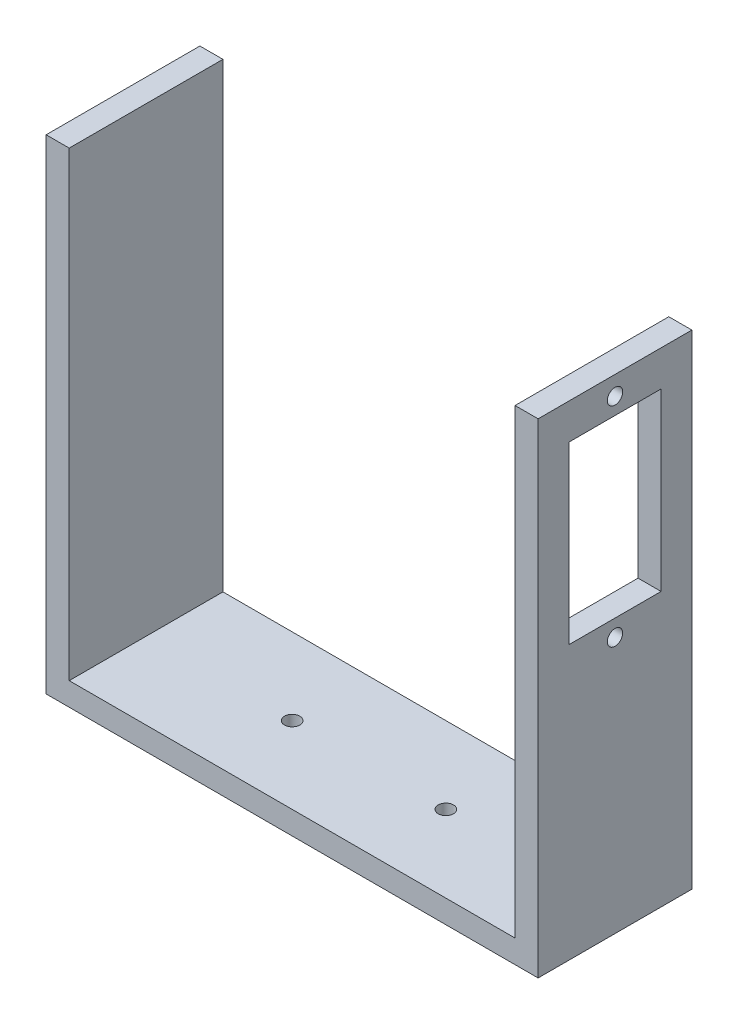
ISO-10303-21;
HEADER;
FILE_DESCRIPTION(('STEP AP214'),'2;1');
FILE_NAME('part.step','',(''),(''),'','','');
FILE_SCHEMA(('AUTOMOTIVE_DESIGN { 1 0 10303 214 1 1 1 1 }'));
ENDSEC;
DATA;
#1=APPLICATION_CONTEXT('core data for automotive mechanical design processes');
#2=APPLICATION_PROTOCOL_DEFINITION('international standard','automotive_design',2000,#1);
#3=PRODUCT_CONTEXT('',#1,'mechanical');
#4=PRODUCT('Part','Part','',(#3));
#5=PRODUCT_RELATED_PRODUCT_CATEGORY('part','',(#4));
#6=PRODUCT_DEFINITION_FORMATION('','',#4);
#7=PRODUCT_DEFINITION_CONTEXT('part definition',#1,'design');
#8=PRODUCT_DEFINITION('design','',#6,#7);
#9=PRODUCT_DEFINITION_SHAPE('','',#8);
#10=(LENGTH_UNIT() NAMED_UNIT(*) SI_UNIT(.MILLI.,.METRE.));
#11=(NAMED_UNIT(*) PLANE_ANGLE_UNIT() SI_UNIT($,.RADIAN.));
#12=(NAMED_UNIT(*) SI_UNIT($,.STERADIAN.) SOLID_ANGLE_UNIT());
#13=UNCERTAINTY_MEASURE_WITH_UNIT(LENGTH_MEASURE(1.E-05),#10,'distance_accuracy_value','');
#14=(GEOMETRIC_REPRESENTATION_CONTEXT(3) GLOBAL_UNCERTAINTY_ASSIGNED_CONTEXT((#13)) GLOBAL_UNIT_ASSIGNED_CONTEXT((#10,
#11,#12)) REPRESENTATION_CONTEXT('',''));
#15=CARTESIAN_POINT('',(0.,0.,0.));
#16=DIRECTION('',(0.,0.,1.));
#17=DIRECTION('',(1.,0.,0.));
#18=AXIS2_PLACEMENT_3D('',#15,#16,#17);
#19=CARTESIAN_POINT('',(58.,60.,-20.));
#20=DIRECTION('',(0.,-1.,0.));
#21=DIRECTION('',(0.,0.,-1.));
#22=AXIS2_PLACEMENT_3D('',#19,#20,#21);
#23=PLANE('',#22);
#24=DIRECTION('',(1.,0.,0.));
#25=VECTOR('',#24,1.);
#26=CARTESIAN_POINT('',(58.,60.,0.));
#27=LINE('',#26,#25);
#28=CARTESIAN_POINT('',(58.,60.,0.));
#29=VERTEX_POINT('',#28);
#30=CARTESIAN_POINT('',(61.,60.,0.));
#31=VERTEX_POINT('',#30);
#32=EDGE_CURVE('E181',#29,#31,#27,.T.);
#33=ORIENTED_EDGE('',*,*,#32,.T.);
#34=DIRECTION('',(0.,0.,1.));
#35=VECTOR('',#34,1.);
#36=CARTESIAN_POINT('',(61.,60.,-20.));
#37=LINE('',#36,#35);
#38=CARTESIAN_POINT('',(61.,60.,-20.));
#39=VERTEX_POINT('',#38);
#40=EDGE_CURVE('E217',#39,#31,#37,.T.);
#41=ORIENTED_EDGE('',*,*,#40,.F.);
#42=DIRECTION('',(1.,0.,0.));
#43=VECTOR('',#42,1.);
#44=CARTESIAN_POINT('',(58.,60.,-20.));
#45=LINE('',#44,#43);
#46=CARTESIAN_POINT('',(58.,60.,-20.));
#47=VERTEX_POINT('',#46);
#48=EDGE_CURVE('E159',#47,#39,#45,.T.);
#49=ORIENTED_EDGE('',*,*,#48,.F.);
#50=DIRECTION('',(0.,0.,1.));
#51=VECTOR('',#50,1.);
#52=CARTESIAN_POINT('',(58.,60.,-20.));
#53=LINE('',#52,#51);
#54=EDGE_CURVE('E180',#47,#29,#53,.T.);
#55=ORIENTED_EDGE('',*,*,#54,.T.);
#56=EDGE_LOOP('',(#33,#41,#49,#55));
#57=FACE_BOUND('',#56,.T.);
#58=ADVANCED_FACE('F33',(#57),#23,.F.);
#59=CARTESIAN_POINT('',(61.,60.,-20.));
#60=DIRECTION('',(-1.,0.,0.));
#61=DIRECTION('',(0.,-1.,0.));
#62=AXIS2_PLACEMENT_3D('',#59,#60,#61);
#63=PLANE('',#62);
#64=DIRECTION('',(0.,-1.,0.));
#65=VECTOR('',#64,1.);
#66=CARTESIAN_POINT('',(61.,55.3660771735499,-4.));
#67=LINE('',#66,#65);
#68=CARTESIAN_POINT('',(61.,55.3660771735499,-4.));
#69=VERTEX_POINT('',#68);
#70=CARTESIAN_POINT('',(61.,32.55,-4.));
#71=VERTEX_POINT('',#70);
#72=EDGE_CURVE('E133',#69,#71,#67,.T.);
#73=ORIENTED_EDGE('',*,*,#72,.F.);
#74=DIRECTION('',(0.,0.,1.));
#75=VECTOR('',#74,1.);
#76=CARTESIAN_POINT('',(61.,55.3660771735499,-10.));
#77=LINE('',#76,#75);
#78=CARTESIAN_POINT('',(61.,55.3660771735499,-16.));
#79=VERTEX_POINT('',#78);
#80=EDGE_CURVE('E47',#79,#69,#77,.T.);
#81=ORIENTED_EDGE('',*,*,#80,.F.);
#82=DIRECTION('',(0.,1.,0.));
#83=VECTOR('',#82,1.);
#84=CARTESIAN_POINT('',(61.,55.3660771735499,-16.));
#85=LINE('',#84,#83);
#86=CARTESIAN_POINT('',(61.,32.55,-16.));
#87=VERTEX_POINT('',#86);
#88=EDGE_CURVE('E141',#87,#79,#85,.T.);
#89=ORIENTED_EDGE('',*,*,#88,.F.);
#90=DIRECTION('',(0.,0.,-1.));
#91=VECTOR('',#90,1.);
#92=CARTESIAN_POINT('',(61.,32.55,-10.));
#93=LINE('',#92,#91);
#94=EDGE_CURVE('E124',#71,#87,#93,.T.);
#95=ORIENTED_EDGE('',*,*,#94,.F.);
#96=EDGE_LOOP('',(#73,#81,#89,#95));
#97=FACE_BOUND('',#96,.T.);
#98=CARTESIAN_POINT('',(61.,30.375,-10.));
#99=DIRECTION('',(1.,0.,0.));
#100=DIRECTION('',(0.,1.,0.));
#101=AXIS2_PLACEMENT_3D('',#98,#99,#100);
#102=CIRCLE('',#101,1.);
#103=CARTESIAN_POINT('',(61.,31.375,-10.));
#104=VERTEX_POINT('',#103);
#105=EDGE_CURVE('E149',#104,#104,#102,.T.);
#106=ORIENTED_EDGE('',*,*,#105,.F.);
#107=EDGE_LOOP('',(#106));
#108=FACE_BOUND('',#107,.T.);
#109=CARTESIAN_POINT('',(61.,57.5410771735499,-10.));
#110=DIRECTION('',(1.,0.,0.));
#111=DIRECTION('',(0.,1.,0.));
#112=AXIS2_PLACEMENT_3D('',#109,#110,#111);
#113=CIRCLE('',#112,1.);
#114=CARTESIAN_POINT('',(61.,58.5410771735499,-10.));
#115=VERTEX_POINT('',#114);
#116=EDGE_CURVE('E155',#115,#115,#113,.T.);
#117=ORIENTED_EDGE('',*,*,#116,.F.);
#118=EDGE_LOOP('',(#117));
#119=FACE_BOUND('',#118,.T.);
#120=DIRECTION('',(0.,-1.,0.));
#121=VECTOR('',#120,1.);
#122=CARTESIAN_POINT('',(61.,60.,0.));
#123=LINE('',#122,#121);
#124=CARTESIAN_POINT('',(61.,-3.,0.));
#125=VERTEX_POINT('',#124);
#126=EDGE_CURVE('E184',#31,#125,#123,.T.);
#127=ORIENTED_EDGE('',*,*,#126,.T.);
#128=DIRECTION('',(0.,0.,1.));
#129=VECTOR('',#128,1.);
#130=CARTESIAN_POINT('',(61.,-3.,-20.));
#131=LINE('',#130,#129);
#132=CARTESIAN_POINT('',(61.,-3.,-20.));
#133=VERTEX_POINT('',#132);
#134=EDGE_CURVE('E214',#133,#125,#131,.T.);
#135=ORIENTED_EDGE('',*,*,#134,.F.);
#136=DIRECTION('',(0.,-1.,0.));
#137=VECTOR('',#136,1.);
#138=CARTESIAN_POINT('',(61.,60.,-20.));
#139=LINE('',#138,#137);
#140=EDGE_CURVE('E162',#39,#133,#139,.T.);
#141=ORIENTED_EDGE('',*,*,#140,.F.);
#142=ORIENTED_EDGE('',*,*,#40,.T.);
#143=EDGE_LOOP('',(#127,#135,#141,#142));
#144=FACE_BOUND('',#143,.T.);
#145=ADVANCED_FACE('F138',(#97,#108,#119,#144),#63,.F.);
#146=CARTESIAN_POINT('',(61.,-3.,-20.));
#147=DIRECTION('',(0.,1.,0.));
#148=DIRECTION('',(-1.,0.,0.));
#149=AXIS2_PLACEMENT_3D('',#146,#147,#148);
#150=PLANE('',#149);
#151=CARTESIAN_POINT('',(39.,-3.00000000000001,-10.));
#152=DIRECTION('',(0.,1.,0.));
#153=DIRECTION('',(-1.,0.,0.));
#154=AXIS2_PLACEMENT_3D('',#151,#152,#153);
#155=CIRCLE('',#154,0.999999999999998);
#156=CARTESIAN_POINT('',(38.,-3.00000000000001,-10.));
#157=VERTEX_POINT('',#156);
#158=EDGE_CURVE('E435',#157,#157,#155,.T.);
#159=ORIENTED_EDGE('',*,*,#158,.T.);
#160=EDGE_LOOP('',(#159));
#161=FACE_BOUND('',#160,.T.);
#162=CARTESIAN_POINT('',(19.,-3.00000000000001,-10.));
#163=DIRECTION('',(0.,1.,0.));
#164=DIRECTION('',(-1.,0.,0.));
#165=AXIS2_PLACEMENT_3D('',#162,#163,#164);
#166=CIRCLE('',#165,1.);
#167=CARTESIAN_POINT('',(18.,-3.00000000000001,-10.));
#168=VERTEX_POINT('',#167);
#169=EDGE_CURVE('E136',#168,#168,#166,.T.);
#170=ORIENTED_EDGE('',*,*,#169,.T.);
#171=EDGE_LOOP('',(#170));
#172=FACE_BOUND('',#171,.T.);
#173=DIRECTION('',(-1.,0.,0.));
#174=VECTOR('',#173,1.);
#175=CARTESIAN_POINT('',(61.,-3.,0.));
#176=LINE('',#175,#174);
#177=CARTESIAN_POINT('',(-2.99999999999999,-3.00000000000001,0.));
#178=VERTEX_POINT('',#177);
#179=EDGE_CURVE('E186',#125,#178,#176,.T.);
#180=ORIENTED_EDGE('',*,*,#179,.T.);
#181=DIRECTION('',(0.,0.,1.));
#182=VECTOR('',#181,1.);
#183=CARTESIAN_POINT('',(-2.99999999999999,-3.00000000000001,-20.));
#184=LINE('',#183,#182);
#185=CARTESIAN_POINT('',(-2.99999999999999,-3.00000000000001,-20.));
#186=VERTEX_POINT('',#185);
#187=EDGE_CURVE('E212',#186,#178,#184,.T.);
#188=ORIENTED_EDGE('',*,*,#187,.F.);
#189=DIRECTION('',(-1.,0.,0.));
#190=VECTOR('',#189,1.);
#191=CARTESIAN_POINT('',(61.,-3.,-20.));
#192=LINE('',#191,#190);
#193=EDGE_CURVE('E165',#133,#186,#192,.T.);
#194=ORIENTED_EDGE('',*,*,#193,.F.);
#195=ORIENTED_EDGE('',*,*,#134,.T.);
#196=EDGE_LOOP('',(#180,#188,#194,#195));
#197=FACE_BOUND('',#196,.T.);
#198=ADVANCED_FACE('F251',(#161,#172,#197),#150,.F.);
#199=CARTESIAN_POINT('',(-3.,60.,-20.));
#200=DIRECTION('',(-1.,0.,0.));
#201=DIRECTION('',(0.,-1.,0.));
#202=AXIS2_PLACEMENT_3D('',#199,#200,#201);
#203=PLANE('',#202);
#204=DIRECTION('',(0.,-1.,0.));
#205=VECTOR('',#204,1.);
#206=CARTESIAN_POINT('',(-3.,60.,0.));
#207=LINE('',#206,#205);
#208=CARTESIAN_POINT('',(-3.,60.,0.));
#209=VERTEX_POINT('',#208);
#210=EDGE_CURVE('E189',#209,#178,#207,.T.);
#211=ORIENTED_EDGE('',*,*,#210,.F.);
#212=DIRECTION('',(0.,0.,1.));
#213=VECTOR('',#212,1.);
#214=CARTESIAN_POINT('',(-3.,60.,-20.));
#215=LINE('',#214,#213);
#216=CARTESIAN_POINT('',(-3.,60.,-20.));
#217=VERTEX_POINT('',#216);
#218=EDGE_CURVE('E210',#217,#209,#215,.T.);
#219=ORIENTED_EDGE('',*,*,#218,.F.);
#220=DIRECTION('',(0.,-1.,0.));
#221=VECTOR('',#220,1.);
#222=CARTESIAN_POINT('',(-3.,60.,-20.));
#223=LINE('',#222,#221);
#224=EDGE_CURVE('E167',#217,#186,#223,.T.);
#225=ORIENTED_EDGE('',*,*,#224,.T.);
#226=ORIENTED_EDGE('',*,*,#187,.T.);
#227=EDGE_LOOP('',(#211,#219,#225,#226));
#228=FACE_BOUND('',#227,.T.);
#229=ADVANCED_FACE('F282',(#228),#203,.T.);
#230=CARTESIAN_POINT('',(0.,60.,-20.));
#231=DIRECTION('',(0.,1.,0.));
#232=DIRECTION('',(0.,0.,1.));
#233=AXIS2_PLACEMENT_3D('',#230,#231,#232);
#234=PLANE('',#233);
#235=DIRECTION('',(-1.,0.,0.));
#236=VECTOR('',#235,1.);
#237=CARTESIAN_POINT('',(0.,60.,0.));
#238=LINE('',#237,#236);
#239=CARTESIAN_POINT('',(0.,60.,0.));
#240=VERTEX_POINT('',#239);
#241=EDGE_CURVE('E192',#240,#209,#238,.T.);
#242=ORIENTED_EDGE('',*,*,#241,.F.);
#243=DIRECTION('',(0.,0.,1.));
#244=VECTOR('',#243,1.);
#245=CARTESIAN_POINT('',(0.,60.,-20.));
#246=LINE('',#245,#244);
#247=CARTESIAN_POINT('',(0.,60.,-20.));
#248=VERTEX_POINT('',#247);
#249=EDGE_CURVE('E208',#248,#240,#246,.T.);
#250=ORIENTED_EDGE('',*,*,#249,.F.);
#251=DIRECTION('',(-1.,0.,0.));
#252=VECTOR('',#251,1.);
#253=CARTESIAN_POINT('',(0.,60.,-20.));
#254=LINE('',#253,#252);
#255=EDGE_CURVE('E170',#248,#217,#254,.T.);
#256=ORIENTED_EDGE('',*,*,#255,.T.);
#257=ORIENTED_EDGE('',*,*,#218,.T.);
#258=EDGE_LOOP('',(#242,#250,#256,#257));
#259=FACE_BOUND('',#258,.T.);
#260=ADVANCED_FACE('F279',(#259),#234,.T.);
#261=CARTESIAN_POINT('',(0.,0.,-20.));
#262=DIRECTION('',(1.,0.,0.));
#263=DIRECTION('',(0.,0.,-1.));
#264=AXIS2_PLACEMENT_3D('',#261,#262,#263);
#265=PLANE('',#264);
#266=DIRECTION('',(0.,1.,0.));
#267=VECTOR('',#266,1.);
#268=CARTESIAN_POINT('',(0.,0.,0.));
#269=LINE('',#268,#267);
#270=CARTESIAN_POINT('',(0.,0.,0.));
#271=VERTEX_POINT('',#270);
#272=EDGE_CURVE('E195',#271,#240,#269,.T.);
#273=ORIENTED_EDGE('',*,*,#272,.F.);
#274=DIRECTION('',(0.,0.,1.));
#275=VECTOR('',#274,1.);
#276=CARTESIAN_POINT('',(0.,0.,-20.));
#277=LINE('',#276,#275);
#278=CARTESIAN_POINT('',(0.,0.,-20.));
#279=VERTEX_POINT('',#278);
#280=EDGE_CURVE('E206',#279,#271,#277,.T.);
#281=ORIENTED_EDGE('',*,*,#280,.F.);
#282=DIRECTION('',(0.,1.,0.));
#283=VECTOR('',#282,1.);
#284=CARTESIAN_POINT('',(0.,0.,-20.));
#285=LINE('',#284,#283);
#286=EDGE_CURVE('E173',#279,#248,#285,.T.);
#287=ORIENTED_EDGE('',*,*,#286,.T.);
#288=ORIENTED_EDGE('',*,*,#249,.T.);
#289=EDGE_LOOP('',(#273,#281,#287,#288));
#290=FACE_BOUND('',#289,.T.);
#291=ADVANCED_FACE('F275',(#290),#265,.T.);
#292=CARTESIAN_POINT('',(0.,0.,-20.));
#293=DIRECTION('',(0.,-1.,0.));
#294=DIRECTION('',(0.,0.,-1.));
#295=AXIS2_PLACEMENT_3D('',#292,#293,#294);
#296=PLANE('',#295);
#297=CARTESIAN_POINT('',(39.,0.,-10.));
#298=DIRECTION('',(0.,1.,0.));
#299=DIRECTION('',(0.,0.,1.));
#300=AXIS2_PLACEMENT_3D('',#297,#298,#299);
#301=CIRCLE('',#300,0.999999999999998);
#302=CARTESIAN_POINT('',(39.,0.,-9.00000000000001));
#303=VERTEX_POINT('',#302);
#304=EDGE_CURVE('E433',#303,#303,#301,.T.);
#305=ORIENTED_EDGE('',*,*,#304,.F.);
#306=EDGE_LOOP('',(#305));
#307=FACE_BOUND('',#306,.T.);
#308=CARTESIAN_POINT('',(19.,0.,-10.));
#309=DIRECTION('',(0.,1.,0.));
#310=DIRECTION('',(0.,0.,1.));
#311=AXIS2_PLACEMENT_3D('',#308,#309,#310);
#312=CIRCLE('',#311,1.);
#313=CARTESIAN_POINT('',(19.,0.,-9.));
#314=VERTEX_POINT('',#313);
#315=EDGE_CURVE('E436',#314,#314,#312,.T.);
#316=ORIENTED_EDGE('',*,*,#315,.F.);
#317=EDGE_LOOP('',(#316));
#318=FACE_BOUND('',#317,.T.);
#319=DIRECTION('',(1.,0.,0.));
#320=VECTOR('',#319,1.);
#321=CARTESIAN_POINT('',(0.,0.,0.));
#322=LINE('',#321,#320);
#323=CARTESIAN_POINT('',(58.,0.,0.));
#324=VERTEX_POINT('',#323);
#325=EDGE_CURVE('E198',#271,#324,#322,.T.);
#326=ORIENTED_EDGE('',*,*,#325,.T.);
#327=DIRECTION('',(0.,0.,1.));
#328=VECTOR('',#327,1.);
#329=CARTESIAN_POINT('',(58.,0.,-20.));
#330=LINE('',#329,#328);
#331=CARTESIAN_POINT('',(58.,0.,-20.));
#332=VERTEX_POINT('',#331);
#333=EDGE_CURVE('E203',#332,#324,#330,.T.);
#334=ORIENTED_EDGE('',*,*,#333,.F.);
#335=DIRECTION('',(1.,0.,0.));
#336=VECTOR('',#335,1.);
#337=CARTESIAN_POINT('',(0.,0.,-20.));
#338=LINE('',#337,#336);
#339=EDGE_CURVE('E176',#279,#332,#338,.T.);
#340=ORIENTED_EDGE('',*,*,#339,.F.);
#341=ORIENTED_EDGE('',*,*,#280,.T.);
#342=EDGE_LOOP('',(#326,#334,#340,#341));
#343=FACE_BOUND('',#342,.T.);
#344=ADVANCED_FACE('F272',(#307,#318,#343),#296,.F.);
#345=CARTESIAN_POINT('',(58.,0.,-20.));
#346=DIRECTION('',(1.,0.,0.));
#347=DIRECTION('',(0.,0.,-1.));
#348=AXIS2_PLACEMENT_3D('',#345,#346,#347);
#349=PLANE('',#348);
#350=DIRECTION('',(0.,1.,0.));
#351=VECTOR('',#350,1.);
#352=CARTESIAN_POINT('',(58.,0.,-16.));
#353=LINE('',#352,#351);
#354=CARTESIAN_POINT('',(58.,32.55,-16.));
#355=VERTEX_POINT('',#354);
#356=CARTESIAN_POINT('',(58.,55.3660771735499,-16.));
#357=VERTEX_POINT('',#356);
#358=EDGE_CURVE('E40',#355,#357,#353,.T.);
#359=ORIENTED_EDGE('',*,*,#358,.T.);
#360=DIRECTION('',(0.,0.,1.));
#361=VECTOR('',#360,1.);
#362=CARTESIAN_POINT('',(58.,55.3660771735499,-20.));
#363=LINE('',#362,#361);
#364=CARTESIAN_POINT('',(58.,55.3660771735499,-4.));
#365=VERTEX_POINT('',#364);
#366=EDGE_CURVE('E11',#357,#365,#363,.T.);
#367=ORIENTED_EDGE('',*,*,#366,.T.);
#368=DIRECTION('',(0.,-1.,0.));
#369=VECTOR('',#368,1.);
#370=CARTESIAN_POINT('',(58.,0.,-4.));
#371=LINE('',#370,#369);
#372=CARTESIAN_POINT('',(58.,32.55,-4.));
#373=VERTEX_POINT('',#372);
#374=EDGE_CURVE('E220',#365,#373,#371,.T.);
#375=ORIENTED_EDGE('',*,*,#374,.T.);
#376=DIRECTION('',(0.,0.,-1.));
#377=VECTOR('',#376,1.);
#378=CARTESIAN_POINT('',(58.,32.55,-20.));
#379=LINE('',#378,#377);
#380=EDGE_CURVE('E127',#373,#355,#379,.T.);
#381=ORIENTED_EDGE('',*,*,#380,.T.);
#382=EDGE_LOOP('',(#359,#367,#375,#381));
#383=FACE_BOUND('',#382,.T.);
#384=CARTESIAN_POINT('',(58.,30.375,-10.));
#385=DIRECTION('',(1.,0.,0.));
#386=DIRECTION('',(0.,0.,-1.));
#387=AXIS2_PLACEMENT_3D('',#384,#385,#386);
#388=CIRCLE('',#387,1.);
#389=CARTESIAN_POINT('',(58.,30.375,-11.));
#390=VERTEX_POINT('',#389);
#391=EDGE_CURVE('E154',#390,#390,#388,.T.);
#392=ORIENTED_EDGE('',*,*,#391,.T.);
#393=EDGE_LOOP('',(#392));
#394=FACE_BOUND('',#393,.T.);
#395=CARTESIAN_POINT('',(58.,57.5410771735499,-10.));
#396=DIRECTION('',(1.,0.,0.));
#397=DIRECTION('',(0.,0.,-1.));
#398=AXIS2_PLACEMENT_3D('',#395,#396,#397);
#399=CIRCLE('',#398,1.);
#400=CARTESIAN_POINT('',(58.,57.5410771735499,-11.));
#401=VERTEX_POINT('',#400);
#402=EDGE_CURVE('E158',#401,#401,#399,.T.);
#403=ORIENTED_EDGE('',*,*,#402,.T.);
#404=EDGE_LOOP('',(#403));
#405=FACE_BOUND('',#404,.T.);
#406=DIRECTION('',(0.,1.,0.));
#407=VECTOR('',#406,1.);
#408=CARTESIAN_POINT('',(58.,0.,0.));
#409=LINE('',#408,#407);
#410=EDGE_CURVE('E163',#324,#29,#409,.T.);
#411=ORIENTED_EDGE('',*,*,#410,.T.);
#412=ORIENTED_EDGE('',*,*,#54,.F.);
#413=DIRECTION('',(0.,1.,0.));
#414=VECTOR('',#413,1.);
#415=CARTESIAN_POINT('',(58.,0.,-20.));
#416=LINE('',#415,#414);
#417=EDGE_CURVE('E178',#332,#47,#416,.T.);
#418=ORIENTED_EDGE('',*,*,#417,.F.);
#419=ORIENTED_EDGE('',*,*,#333,.T.);
#420=EDGE_LOOP('',(#411,#412,#418,#419));
#421=FACE_BOUND('',#420,.T.);
#422=ADVANCED_FACE('F228',(#383,#394,#405,#421),#349,.F.);
#423=CARTESIAN_POINT('',(0.,0.,-20.));
#424=DIRECTION('',(0.,0.,-1.));
#425=DIRECTION('',(-1.,0.,0.));
#426=AXIS2_PLACEMENT_3D('',#423,#424,#425);
#427=PLANE('',#426);
#428=ORIENTED_EDGE('',*,*,#48,.T.);
#429=ORIENTED_EDGE('',*,*,#140,.T.);
#430=ORIENTED_EDGE('',*,*,#193,.T.);
#431=ORIENTED_EDGE('',*,*,#224,.F.);
#432=ORIENTED_EDGE('',*,*,#255,.F.);
#433=ORIENTED_EDGE('',*,*,#286,.F.);
#434=ORIENTED_EDGE('',*,*,#339,.T.);
#435=ORIENTED_EDGE('',*,*,#417,.T.);
#436=EDGE_LOOP('',(#428,#429,#430,#431,#432,#433,#434,#435));
#437=FACE_BOUND('',#436,.T.);
#438=ADVANCED_FACE('F265',(#437),#427,.T.);
#439=CARTESIAN_POINT('',(0.,0.,0.));
#440=DIRECTION('',(0.,0.,-1.));
#441=DIRECTION('',(-1.,0.,0.));
#442=AXIS2_PLACEMENT_3D('',#439,#440,#441);
#443=PLANE('',#442);
#444=ORIENTED_EDGE('',*,*,#32,.F.);
#445=ORIENTED_EDGE('',*,*,#410,.F.);
#446=ORIENTED_EDGE('',*,*,#325,.F.);
#447=ORIENTED_EDGE('',*,*,#272,.T.);
#448=ORIENTED_EDGE('',*,*,#241,.T.);
#449=ORIENTED_EDGE('',*,*,#210,.T.);
#450=ORIENTED_EDGE('',*,*,#179,.F.);
#451=ORIENTED_EDGE('',*,*,#126,.F.);
#452=EDGE_LOOP('',(#444,#445,#446,#447,#448,#449,#450,#451));
#453=FACE_BOUND('',#452,.T.);
#454=ADVANCED_FACE('F258',(#453),#443,.F.);
#455=CARTESIAN_POINT('',(51.,57.5410771735499,-10.));
#456=DIRECTION('',(1.,0.,0.));
#457=DIRECTION('',(0.,1.,0.));
#458=AXIS2_PLACEMENT_3D('',#455,#456,#457);
#459=CYLINDRICAL_SURFACE('',#458,1.);
#460=ORIENTED_EDGE('',*,*,#116,.T.);
#461=EDGE_LOOP('',(#460));
#462=FACE_BOUND('',#461,.T.);
#463=ORIENTED_EDGE('',*,*,#402,.F.);
#464=EDGE_LOOP('',(#463));
#465=FACE_BOUND('',#464,.T.);
#466=ADVANCED_FACE('F242',(#462,#465),#459,.F.);
#467=CARTESIAN_POINT('',(51.,30.375,-10.));
#468=DIRECTION('',(1.,0.,0.));
#469=DIRECTION('',(0.,1.,0.));
#470=AXIS2_PLACEMENT_3D('',#467,#468,#469);
#471=CYLINDRICAL_SURFACE('',#470,1.);
#472=ORIENTED_EDGE('',*,*,#105,.T.);
#473=EDGE_LOOP('',(#472));
#474=FACE_BOUND('',#473,.T.);
#475=ORIENTED_EDGE('',*,*,#391,.F.);
#476=EDGE_LOOP('',(#475));
#477=FACE_BOUND('',#476,.T.);
#478=ADVANCED_FACE('F235',(#474,#477),#471,.F.);
#479=CARTESIAN_POINT('',(51.,55.3660771735499,-10.));
#480=DIRECTION('',(0.,1.,0.));
#481=DIRECTION('',(-1.,0.,0.));
#482=AXIS2_PLACEMENT_3D('',#479,#480,#481);
#483=PLANE('',#482);
#484=DIRECTION('',(1.,0.,0.));
#485=VECTOR('',#484,1.);
#486=CARTESIAN_POINT('',(51.,55.3660771735499,-16.));
#487=LINE('',#486,#485);
#488=EDGE_CURVE('E147',#357,#79,#487,.T.);
#489=ORIENTED_EDGE('',*,*,#488,.T.);
#490=ORIENTED_EDGE('',*,*,#80,.T.);
#491=DIRECTION('',(1.,0.,0.));
#492=VECTOR('',#491,1.);
#493=CARTESIAN_POINT('',(51.,55.3660771735499,-4.));
#494=LINE('',#493,#492);
#495=EDGE_CURVE('E130',#365,#69,#494,.T.);
#496=ORIENTED_EDGE('',*,*,#495,.F.);
#497=ORIENTED_EDGE('',*,*,#366,.F.);
#498=EDGE_LOOP('',(#489,#490,#496,#497));
#499=FACE_BOUND('',#498,.T.);
#500=ADVANCED_FACE('F233',(#499),#483,.F.);
#501=CARTESIAN_POINT('',(51.,55.3660771735499,-16.));
#502=DIRECTION('',(0.,0.,-1.));
#503=DIRECTION('',(0.,1.,0.));
#504=AXIS2_PLACEMENT_3D('',#501,#502,#503);
#505=PLANE('',#504);
#506=DIRECTION('',(1.,0.,0.));
#507=VECTOR('',#506,1.);
#508=CARTESIAN_POINT('',(51.,32.55,-16.));
#509=LINE('',#508,#507);
#510=EDGE_CURVE('E129',#355,#87,#509,.T.);
#511=ORIENTED_EDGE('',*,*,#510,.T.);
#512=ORIENTED_EDGE('',*,*,#88,.T.);
#513=ORIENTED_EDGE('',*,*,#488,.F.);
#514=ORIENTED_EDGE('',*,*,#358,.F.);
#515=EDGE_LOOP('',(#511,#512,#513,#514));
#516=FACE_BOUND('',#515,.T.);
#517=ADVANCED_FACE('F232',(#516),#505,.F.);
#518=CARTESIAN_POINT('',(51.,32.55,-10.));
#519=DIRECTION('',(0.,-1.,0.));
#520=DIRECTION('',(1.,0.,0.));
#521=AXIS2_PLACEMENT_3D('',#518,#519,#520);
#522=PLANE('',#521);
#523=DIRECTION('',(1.,0.,0.));
#524=VECTOR('',#523,1.);
#525=CARTESIAN_POINT('',(51.,32.55,-4.));
#526=LINE('',#525,#524);
#527=EDGE_CURVE('E55',#373,#71,#526,.T.);
#528=ORIENTED_EDGE('',*,*,#527,.T.);
#529=ORIENTED_EDGE('',*,*,#94,.T.);
#530=ORIENTED_EDGE('',*,*,#510,.F.);
#531=ORIENTED_EDGE('',*,*,#380,.F.);
#532=EDGE_LOOP('',(#528,#529,#530,#531));
#533=FACE_BOUND('',#532,.T.);
#534=ADVANCED_FACE('F121',(#533),#522,.F.);
#535=CARTESIAN_POINT('',(51.,55.3660771735499,-4.));
#536=DIRECTION('',(0.,0.,1.));
#537=DIRECTION('',(1.,0.,0.));
#538=AXIS2_PLACEMENT_3D('',#535,#536,#537);
#539=PLANE('',#538);
#540=ORIENTED_EDGE('',*,*,#495,.T.);
#541=ORIENTED_EDGE('',*,*,#72,.T.);
#542=ORIENTED_EDGE('',*,*,#527,.F.);
#543=ORIENTED_EDGE('',*,*,#374,.F.);
#544=EDGE_LOOP('',(#540,#541,#542,#543));
#545=FACE_BOUND('',#544,.T.);
#546=ADVANCED_FACE('F134',(#545),#539,.F.);
#547=CARTESIAN_POINT('',(19.,-10.,-10.));
#548=DIRECTION('',(0.,1.,0.));
#549=DIRECTION('',(0.,0.,1.));
#550=AXIS2_PLACEMENT_3D('',#547,#548,#549);
#551=CYLINDRICAL_SURFACE('',#550,1.);
#552=ORIENTED_EDGE('',*,*,#315,.T.);
#553=EDGE_LOOP('',(#552));
#554=FACE_BOUND('',#553,.T.);
#555=ORIENTED_EDGE('',*,*,#169,.F.);
#556=EDGE_LOOP('',(#555));
#557=FACE_BOUND('',#556,.T.);
#558=ADVANCED_FACE('F314',(#554,#557),#551,.F.);
#559=CARTESIAN_POINT('',(39.,-10.,-10.));
#560=DIRECTION('',(0.,1.,0.));
#561=DIRECTION('',(0.,0.,1.));
#562=AXIS2_PLACEMENT_3D('',#559,#560,#561);
#563=CYLINDRICAL_SURFACE('',#562,0.999999999999998);
#564=ORIENTED_EDGE('',*,*,#304,.T.);
#565=EDGE_LOOP('',(#564));
#566=FACE_BOUND('',#565,.T.);
#567=ORIENTED_EDGE('',*,*,#158,.F.);
#568=EDGE_LOOP('',(#567));
#569=FACE_BOUND('',#568,.T.);
#570=ADVANCED_FACE('F330',(#566,#569),#563,.F.);
#571=CLOSED_SHELL('',(#58,#145,#198,#229,#260,#291,#344,#422,#438,#454,#466,#478,#500,#517,#534,
#546,#558,#570));
#572=MANIFOLD_SOLID_BREP('B2',#571);
#573=ADVANCED_BREP_SHAPE_REPRESENTATION('',(#18,#572),#14);
#574=SHAPE_DEFINITION_REPRESENTATION(#9,#573);
ENDSEC;
END-ISO-10303-21;
